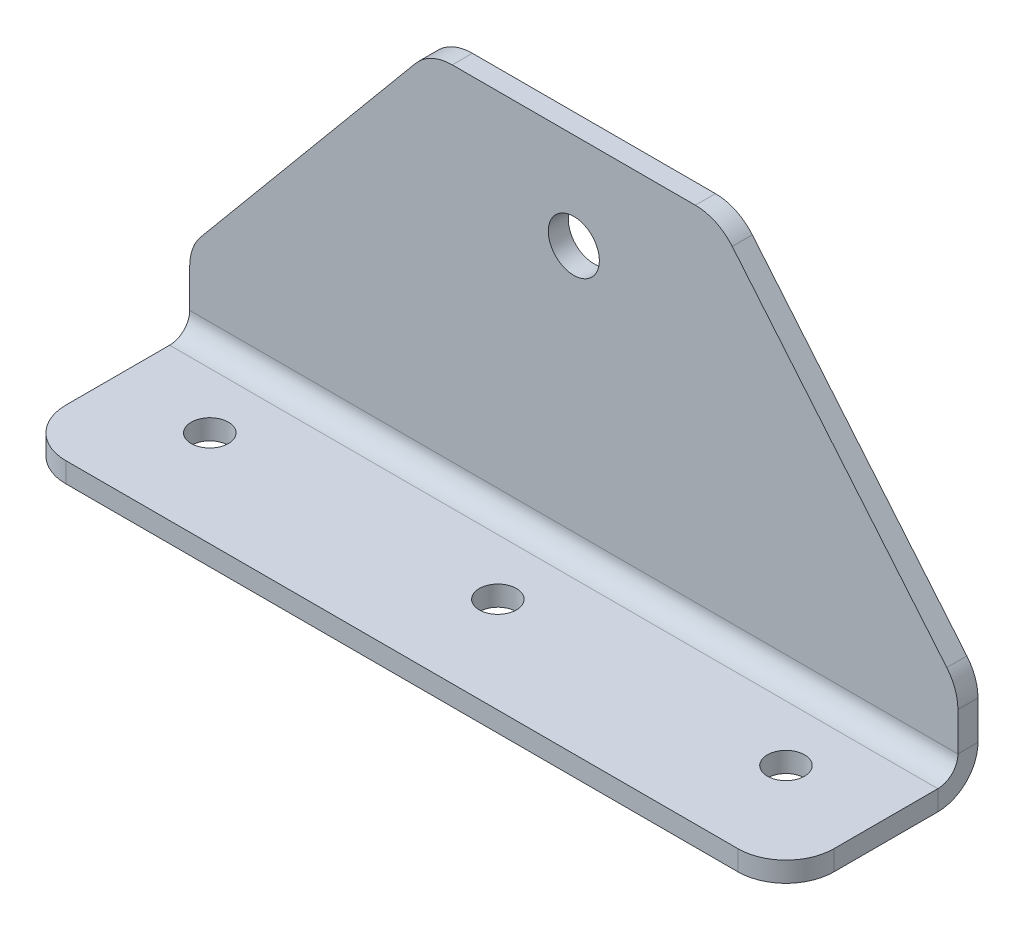
ISO-10303-21;
HEADER;
FILE_DESCRIPTION(('STEP AP214'),'2;1');
FILE_NAME('part.step','',(''),(''),'','','');
FILE_SCHEMA(('AUTOMOTIVE_DESIGN { 1 0 10303 214 1 1 1 1 }'));
ENDSEC;
DATA;
#1=APPLICATION_CONTEXT('core data for automotive mechanical design processes');
#2=APPLICATION_PROTOCOL_DEFINITION('international standard','automotive_design',2000,#1);
#3=PRODUCT_CONTEXT('',#1,'mechanical');
#4=PRODUCT('Part','Part','',(#3));
#5=PRODUCT_RELATED_PRODUCT_CATEGORY('part','',(#4));
#6=PRODUCT_DEFINITION_FORMATION('','',#4);
#7=PRODUCT_DEFINITION_CONTEXT('part definition',#1,'design');
#8=PRODUCT_DEFINITION('design','',#6,#7);
#9=PRODUCT_DEFINITION_SHAPE('','',#8);
#10=(LENGTH_UNIT() NAMED_UNIT(*) SI_UNIT(.MILLI.,.METRE.));
#11=(NAMED_UNIT(*) PLANE_ANGLE_UNIT() SI_UNIT($,.RADIAN.));
#12=(NAMED_UNIT(*) SI_UNIT($,.STERADIAN.) SOLID_ANGLE_UNIT());
#13=UNCERTAINTY_MEASURE_WITH_UNIT(LENGTH_MEASURE(1.E-05),#10,'distance_accuracy_value','');
#14=(GEOMETRIC_REPRESENTATION_CONTEXT(3) GLOBAL_UNCERTAINTY_ASSIGNED_CONTEXT((#13)) GLOBAL_UNIT_ASSIGNED_CONTEXT((#10,
#11,#12)) REPRESENTATION_CONTEXT('',''));
#15=CARTESIAN_POINT('',(0.,0.,0.));
#16=DIRECTION('',(0.,0.,1.));
#17=DIRECTION('',(1.,0.,0.));
#18=AXIS2_PLACEMENT_3D('',#15,#16,#17);
#19=CARTESIAN_POINT('',(101.6,12.7,-2.65684));
#20=DIRECTION('',(1.,0.,0.));
#21=DIRECTION('',(0.,0.,-1.));
#22=AXIS2_PLACEMENT_3D('',#19,#20,#21);
#23=PLANE('',#22);
#24=DIRECTION('',(0.,1.,0.));
#25=VECTOR('',#24,1.);
#26=CARTESIAN_POINT('',(101.6,12.7,-2.65684));
#27=LINE('',#26,#25);
#28=CARTESIAN_POINT('',(101.6,5.31368,-2.65684000000001));
#29=VERTEX_POINT('',#28);
#30=CARTESIAN_POINT('',(101.6,10.4009829115986,-2.65684));
#31=VERTEX_POINT('',#30);
#32=EDGE_CURVE('E263',#29,#31,#27,.T.);
#33=ORIENTED_EDGE('',*,*,#32,.T.);
#34=DIRECTION('',(0.,0.,1.));
#35=VECTOR('',#34,1.);
#36=CARTESIAN_POINT('',(101.6,10.4009829115986,-2.65684));
#37=LINE('',#36,#35);
#38=CARTESIAN_POINT('',(101.6,10.4009829115986,0.));
#39=VERTEX_POINT('',#38);
#40=EDGE_CURVE('E324',#31,#39,#37,.T.);
#41=ORIENTED_EDGE('',*,*,#40,.T.);
#42=DIRECTION('',(0.,1.,0.));
#43=VECTOR('',#42,1.);
#44=CARTESIAN_POINT('',(101.6,12.7,0.));
#45=LINE('',#44,#43);
#46=CARTESIAN_POINT('',(101.6,5.31367999999999,0.));
#47=VERTEX_POINT('',#46);
#48=EDGE_CURVE('E260',#47,#39,#45,.T.);
#49=ORIENTED_EDGE('',*,*,#48,.F.);
#50=DIRECTION('',(0.,0.,-1.));
#51=VECTOR('',#50,1.);
#52=CARTESIAN_POINT('',(101.6,5.31367999999999,0.));
#53=LINE('',#52,#51);
#54=EDGE_CURVE('E245',#47,#29,#53,.T.);
#55=ORIENTED_EDGE('',*,*,#54,.T.);
#56=EDGE_LOOP('',(#33,#41,#49,#55));
#57=FACE_BOUND('',#56,.T.);
#58=ADVANCED_FACE('F66',(#57),#23,.T.);
#59=CARTESIAN_POINT('',(0.,0.,-2.65684));
#60=DIRECTION('',(0.,0.,-1.));
#61=DIRECTION('',(-1.,0.,0.));
#62=AXIS2_PLACEMENT_3D('',#59,#60,#61);
#63=PLANE('',#62);
#64=CARTESIAN_POINT('',(50.8,38.0999999999999,-2.65684000000001));
#65=DIRECTION('',(0.,0.,1.));
#66=DIRECTION('',(1.,0.,0.));
#67=AXIS2_PLACEMENT_3D('',#64,#65,#66);
#68=CIRCLE('',#67,3.3782);
#69=CARTESIAN_POINT('',(54.1782,38.0999999999999,-2.65684000000001));
#70=VERTEX_POINT('',#69);
#71=EDGE_CURVE('E508',#70,#70,#68,.T.);
#72=ORIENTED_EDGE('',*,*,#71,.T.);
#73=EDGE_LOOP('',(#72));
#74=FACE_BOUND('',#73,.T.);
#75=DIRECTION('',(-0.64018439966448,0.768221279597376,0.));
#76=VECTOR('',#75,1.);
#77=CARTESIAN_POINT('',(69.85,50.8,-2.65684));
#78=LINE('',#77,#76);
#79=CARTESIAN_POINT('',(100.128205125443,14.466153849468,-2.65684));
#80=VERTEX_POINT('',#79);
#81=CARTESIAN_POINT('',(71.7540242184421,48.5151709378694,-2.65684));
#82=VERTEX_POINT('',#81);
#83=EDGE_CURVE('E267',#80,#82,#78,.T.);
#84=ORIENTED_EDGE('',*,*,#83,.F.);
#85=CARTESIAN_POINT('',(95.25,10.4009829115986,-2.65684));
#86=DIRECTION('',(0.,0.,-1.));
#87=DIRECTION('',(-1.,0.,0.));
#88=AXIS2_PLACEMENT_3D('',#85,#86,#87);
#89=CIRCLE('',#88,6.35);
#90=EDGE_CURVE('E355',#80,#31,#89,.T.);
#91=ORIENTED_EDGE('',*,*,#90,.T.);
#92=ORIENTED_EDGE('',*,*,#32,.F.);
#93=DIRECTION('',(1.,0.,0.));
#94=VECTOR('',#93,1.);
#95=CARTESIAN_POINT('',(101.6,5.31368,-2.65684000000001));
#96=LINE('',#95,#94);
#97=CARTESIAN_POINT('',(0.,5.31368000000001,-2.65684));
#98=VERTEX_POINT('',#97);
#99=EDGE_CURVE('E206',#29,#98,#96,.F.);
#100=ORIENTED_EDGE('',*,*,#99,.T.);
#101=DIRECTION('',(0.,-1.,0.));
#102=VECTOR('',#101,1.);
#103=CARTESIAN_POINT('',(0.,0.,-2.65684));
#104=LINE('',#103,#102);
#105=CARTESIAN_POINT('',(0.,10.4009829115986,-2.65684));
#106=VERTEX_POINT('',#105);
#107=EDGE_CURVE('E279',#106,#98,#104,.T.);
#108=ORIENTED_EDGE('',*,*,#107,.F.);
#109=CARTESIAN_POINT('',(6.35,10.4009829115986,-2.65684));
#110=DIRECTION('',(0.,0.,-1.));
#111=DIRECTION('',(-1.,0.,0.));
#112=AXIS2_PLACEMENT_3D('',#109,#110,#111);
#113=CIRCLE('',#112,6.35);
#114=CARTESIAN_POINT('',(1.47179487455666,14.466153849468,-2.65684));
#115=VERTEX_POINT('',#114);
#116=EDGE_CURVE('E347',#106,#115,#113,.T.);
#117=ORIENTED_EDGE('',*,*,#116,.T.);
#118=DIRECTION('',(-0.64018439966448,-0.768221279597376,0.));
#119=VECTOR('',#118,1.);
#120=CARTESIAN_POINT('',(0.,12.7,-2.65684));
#121=LINE('',#120,#119);
#122=CARTESIAN_POINT('',(29.8459757815579,48.5151709378694,-2.65684));
#123=VERTEX_POINT('',#122);
#124=EDGE_CURVE('E275',#123,#115,#121,.T.);
#125=ORIENTED_EDGE('',*,*,#124,.F.);
#126=CARTESIAN_POINT('',(34.7241809070012,44.45,-2.65684));
#127=DIRECTION('',(0.,0.,-1.));
#128=DIRECTION('',(-1.,0.,0.));
#129=AXIS2_PLACEMENT_3D('',#126,#127,#128);
#130=CIRCLE('',#129,6.35);
#131=CARTESIAN_POINT('',(34.7241809070012,50.8,-2.65684));
#132=VERTEX_POINT('',#131);
#133=EDGE_CURVE('E84',#123,#132,#130,.T.);
#134=ORIENTED_EDGE('',*,*,#133,.T.);
#135=DIRECTION('',(-1.,0.,0.));
#136=VECTOR('',#135,1.);
#137=CARTESIAN_POINT('',(31.75,50.8,-2.65684));
#138=LINE('',#137,#136);
#139=CARTESIAN_POINT('',(66.8758190929988,50.8,-2.65684));
#140=VERTEX_POINT('',#139);
#141=EDGE_CURVE('E272',#140,#132,#138,.T.);
#142=ORIENTED_EDGE('',*,*,#141,.F.);
#143=CARTESIAN_POINT('',(66.8758190929988,44.45,-2.65684));
#144=DIRECTION('',(0.,0.,-1.));
#145=DIRECTION('',(-1.,0.,0.));
#146=AXIS2_PLACEMENT_3D('',#143,#144,#145);
#147=CIRCLE('',#146,6.35);
#148=EDGE_CURVE('E352',#140,#82,#147,.T.);
#149=ORIENTED_EDGE('',*,*,#148,.T.);
#150=EDGE_LOOP('',(#84,#91,#92,#100,#108,#117,#125,#134,#142,#149));
#151=FACE_BOUND('',#150,.T.);
#152=ADVANCED_FACE('F441',(#74,#151),#63,.T.);
#153=CARTESIAN_POINT('',(0.,0.,0.));
#154=DIRECTION('',(0.,0.,-1.));
#155=DIRECTION('',(-1.,0.,0.));
#156=AXIS2_PLACEMENT_3D('',#153,#154,#155);
#157=PLANE('',#156);
#158=CARTESIAN_POINT('',(50.8,38.0999999999999,0.));
#159=DIRECTION('',(0.,0.,1.));
#160=DIRECTION('',(1.,0.,0.));
#161=AXIS2_PLACEMENT_3D('',#158,#159,#160);
#162=CIRCLE('',#161,3.37819999999996);
#163=CARTESIAN_POINT('',(54.1782,38.0999999999999,0.));
#164=VERTEX_POINT('',#163);
#165=EDGE_CURVE('E511',#164,#164,#162,.T.);
#166=ORIENTED_EDGE('',*,*,#165,.F.);
#167=EDGE_LOOP('',(#166));
#168=FACE_BOUND('',#167,.T.);
#169=ORIENTED_EDGE('',*,*,#48,.T.);
#170=CARTESIAN_POINT('',(95.25,10.4009829115986,0.));
#171=DIRECTION('',(0.,0.,-1.));
#172=DIRECTION('',(-1.,0.,0.));
#173=AXIS2_PLACEMENT_3D('',#170,#171,#172);
#174=CIRCLE('',#173,6.35);
#175=CARTESIAN_POINT('',(100.128205125443,14.466153849468,0.));
#176=VERTEX_POINT('',#175);
#177=EDGE_CURVE('E337',#39,#176,#174,.F.);
#178=ORIENTED_EDGE('',*,*,#177,.T.);
#179=DIRECTION('',(-0.64018439966448,0.768221279597376,0.));
#180=VECTOR('',#179,1.);
#181=CARTESIAN_POINT('',(69.85,50.8,0.));
#182=LINE('',#181,#180);
#183=CARTESIAN_POINT('',(71.7540242184421,48.5151709378694,0.));
#184=VERTEX_POINT('',#183);
#185=EDGE_CURVE('E286',#176,#184,#182,.T.);
#186=ORIENTED_EDGE('',*,*,#185,.T.);
#187=CARTESIAN_POINT('',(66.8758190929988,44.45,0.));
#188=DIRECTION('',(0.,0.,-1.));
#189=DIRECTION('',(-1.,0.,0.));
#190=AXIS2_PLACEMENT_3D('',#187,#188,#189);
#191=CIRCLE('',#190,6.35);
#192=CARTESIAN_POINT('',(66.8758190929988,50.8,0.));
#193=VERTEX_POINT('',#192);
#194=EDGE_CURVE('E334',#184,#193,#191,.F.);
#195=ORIENTED_EDGE('',*,*,#194,.T.);
#196=DIRECTION('',(-1.,0.,0.));
#197=VECTOR('',#196,1.);
#198=CARTESIAN_POINT('',(31.75,50.8,0.));
#199=LINE('',#198,#197);
#200=CARTESIAN_POINT('',(34.7241809070012,50.8,0.));
#201=VERTEX_POINT('',#200);
#202=EDGE_CURVE('E290',#193,#201,#199,.T.);
#203=ORIENTED_EDGE('',*,*,#202,.T.);
#204=CARTESIAN_POINT('',(34.7241809070012,44.45,0.));
#205=DIRECTION('',(0.,0.,-1.));
#206=DIRECTION('',(-1.,0.,0.));
#207=AXIS2_PLACEMENT_3D('',#204,#205,#206);
#208=CIRCLE('',#207,6.35);
#209=CARTESIAN_POINT('',(29.8459757815579,48.5151709378694,0.));
#210=VERTEX_POINT('',#209);
#211=EDGE_CURVE('E331',#201,#210,#208,.F.);
#212=ORIENTED_EDGE('',*,*,#211,.T.);
#213=DIRECTION('',(-0.64018439966448,-0.768221279597376,0.));
#214=VECTOR('',#213,1.);
#215=CARTESIAN_POINT('',(0.,12.7,0.));
#216=LINE('',#215,#214);
#217=CARTESIAN_POINT('',(1.47179487455666,14.466153849468,0.));
#218=VERTEX_POINT('',#217);
#219=EDGE_CURVE('E294',#210,#218,#216,.T.);
#220=ORIENTED_EDGE('',*,*,#219,.T.);
#221=CARTESIAN_POINT('',(6.35,10.4009829115986,0.));
#222=DIRECTION('',(0.,0.,-1.));
#223=DIRECTION('',(-1.,0.,0.));
#224=AXIS2_PLACEMENT_3D('',#221,#222,#223);
#225=CIRCLE('',#224,6.35);
#226=CARTESIAN_POINT('',(0.,10.4009829115986,0.));
#227=VERTEX_POINT('',#226);
#228=EDGE_CURVE('E328',#218,#227,#225,.F.);
#229=ORIENTED_EDGE('',*,*,#228,.T.);
#230=DIRECTION('',(0.,-1.,0.));
#231=VECTOR('',#230,1.);
#232=CARTESIAN_POINT('',(0.,0.,0.));
#233=LINE('',#232,#231);
#234=CARTESIAN_POINT('',(0.,5.31367999999999,0.));
#235=VERTEX_POINT('',#234);
#236=EDGE_CURVE('E268',#227,#235,#233,.T.);
#237=ORIENTED_EDGE('',*,*,#236,.T.);
#238=DIRECTION('',(1.,0.,0.));
#239=VECTOR('',#238,1.);
#240=CARTESIAN_POINT('',(101.6,5.31367999999999,0.));
#241=LINE('',#240,#239);
#242=EDGE_CURVE('E250',#47,#235,#241,.F.);
#243=ORIENTED_EDGE('',*,*,#242,.F.);
#244=EDGE_LOOP('',(#169,#178,#186,#195,#203,#212,#220,#229,#237,#243));
#245=FACE_BOUND('',#244,.T.);
#246=ADVANCED_FACE('F447',(#168,#245),#157,.F.);
#247=CARTESIAN_POINT('',(0.,0.,-2.65684));
#248=DIRECTION('',(-1.,0.,0.));
#249=DIRECTION('',(0.,0.,1.));
#250=AXIS2_PLACEMENT_3D('',#247,#248,#249);
#251=PLANE('',#250);
#252=ORIENTED_EDGE('',*,*,#236,.F.);
#253=DIRECTION('',(0.,0.,1.));
#254=VECTOR('',#253,1.);
#255=CARTESIAN_POINT('',(0.,10.4009829115986,-2.65684));
#256=LINE('',#255,#254);
#257=EDGE_CURVE('E13',#227,#106,#256,.F.);
#258=ORIENTED_EDGE('',*,*,#257,.T.);
#259=ORIENTED_EDGE('',*,*,#107,.T.);
#260=DIRECTION('',(0.,0.,-1.));
#261=VECTOR('',#260,1.);
#262=CARTESIAN_POINT('',(0.,5.31367999999999,0.));
#263=LINE('',#262,#261);
#264=EDGE_CURVE('E256',#235,#98,#263,.T.);
#265=ORIENTED_EDGE('',*,*,#264,.F.);
#266=EDGE_LOOP('',(#252,#258,#259,#265));
#267=FACE_BOUND('',#266,.T.);
#268=ADVANCED_FACE('F461',(#267),#251,.T.);
#269=CARTESIAN_POINT('',(0.,12.7,-2.65684));
#270=DIRECTION('',(-0.768221279597376,0.64018439966448,0.));
#271=DIRECTION('',(-0.64018439966448,-0.768221279597376,0.));
#272=AXIS2_PLACEMENT_3D('',#269,#270,#271);
#273=PLANE('',#272);
#274=ORIENTED_EDGE('',*,*,#219,.F.);
#275=DIRECTION('',(0.,0.,1.));
#276=VECTOR('',#275,1.);
#277=CARTESIAN_POINT('',(29.8459757815579,48.5151709378694,-2.65684));
#278=LINE('',#277,#276);
#279=EDGE_CURVE('E76',#210,#123,#278,.F.);
#280=ORIENTED_EDGE('',*,*,#279,.T.);
#281=ORIENTED_EDGE('',*,*,#124,.T.);
#282=DIRECTION('',(0.,0.,1.));
#283=VECTOR('',#282,1.);
#284=CARTESIAN_POINT('',(1.47179487455666,14.466153849468,-2.65684));
#285=LINE('',#284,#283);
#286=EDGE_CURVE('E364',#115,#218,#285,.T.);
#287=ORIENTED_EDGE('',*,*,#286,.T.);
#288=EDGE_LOOP('',(#274,#280,#281,#287));
#289=FACE_BOUND('',#288,.T.);
#290=ADVANCED_FACE('F458',(#289),#273,.T.);
#291=CARTESIAN_POINT('',(31.75,50.8,-2.65684));
#292=DIRECTION('',(0.,1.,0.));
#293=DIRECTION('',(-1.,0.,0.));
#294=AXIS2_PLACEMENT_3D('',#291,#292,#293);
#295=PLANE('',#294);
#296=ORIENTED_EDGE('',*,*,#202,.F.);
#297=DIRECTION('',(0.,0.,1.));
#298=VECTOR('',#297,1.);
#299=CARTESIAN_POINT('',(66.8758190929988,50.8,-2.65684));
#300=LINE('',#299,#298);
#301=EDGE_CURVE('E91',#193,#140,#300,.F.);
#302=ORIENTED_EDGE('',*,*,#301,.T.);
#303=ORIENTED_EDGE('',*,*,#141,.T.);
#304=DIRECTION('',(0.,0.,1.));
#305=VECTOR('',#304,1.);
#306=CARTESIAN_POINT('',(34.7241809070012,50.8,-2.65684));
#307=LINE('',#306,#305);
#308=EDGE_CURVE('E358',#132,#201,#307,.T.);
#309=ORIENTED_EDGE('',*,*,#308,.T.);
#310=EDGE_LOOP('',(#296,#302,#303,#309));
#311=FACE_BOUND('',#310,.T.);
#312=ADVANCED_FACE('F454',(#311),#295,.T.);
#313=CARTESIAN_POINT('',(69.85,50.8,-2.65684));
#314=DIRECTION('',(0.768221279597375,0.64018439966448,0.));
#315=DIRECTION('',(-0.64018439966448,0.768221279597376,0.));
#316=AXIS2_PLACEMENT_3D('',#313,#314,#315);
#317=PLANE('',#316);
#318=ORIENTED_EDGE('',*,*,#185,.F.);
#319=DIRECTION('',(0.,0.,1.));
#320=VECTOR('',#319,1.);
#321=CARTESIAN_POINT('',(100.128205125443,14.466153849468,-2.65684));
#322=LINE('',#321,#320);
#323=EDGE_CURVE('E344',#176,#80,#322,.F.);
#324=ORIENTED_EDGE('',*,*,#323,.T.);
#325=ORIENTED_EDGE('',*,*,#83,.T.);
#326=DIRECTION('',(0.,0.,1.));
#327=VECTOR('',#326,1.);
#328=CARTESIAN_POINT('',(71.7540242184421,48.5151709378694,-2.65684));
#329=LINE('',#328,#327);
#330=EDGE_CURVE('E340',#82,#184,#329,.T.);
#331=ORIENTED_EDGE('',*,*,#330,.T.);
#332=EDGE_LOOP('',(#318,#324,#325,#331));
#333=FACE_BOUND('',#332,.T.);
#334=ADVANCED_FACE('F451',(#333),#317,.T.);
#335=CARTESIAN_POINT('',(0.,5.31367999999999,2.65684));
#336=DIRECTION('',(-1.,0.,0.));
#337=DIRECTION('',(0.,0.,1.));
#338=AXIS2_PLACEMENT_3D('',#335,#336,#337);
#339=PLANE('',#338);
#340=DIRECTION('',(0.,-1.,0.));
#341=VECTOR('',#340,1.);
#342=CARTESIAN_POINT('',(0.,0.,2.65683999999998));
#343=LINE('',#342,#341);
#344=CARTESIAN_POINT('',(0.,2.65683999999999,2.65683999999999));
#345=VERTEX_POINT('',#344);
#346=CARTESIAN_POINT('',(0.,0.,2.65683999999998));
#347=VERTEX_POINT('',#346);
#348=EDGE_CURVE('E236',#345,#347,#343,.T.);
#349=ORIENTED_EDGE('',*,*,#348,.F.);
#350=CARTESIAN_POINT('',(0.,5.31367999999999,2.65684));
#351=DIRECTION('',(1.,0.,0.));
#352=DIRECTION('',(0.,0.,-1.));
#353=AXIS2_PLACEMENT_3D('',#350,#351,#352);
#354=CIRCLE('',#353,2.65684);
#355=EDGE_CURVE('E210',#235,#345,#354,.F.);
#356=ORIENTED_EDGE('',*,*,#355,.F.);
#357=ORIENTED_EDGE('',*,*,#264,.T.);
#358=CARTESIAN_POINT('',(0.,5.31367999999999,2.65684));
#359=DIRECTION('',(1.,0.,0.));
#360=DIRECTION('',(0.,0.,-1.));
#361=AXIS2_PLACEMENT_3D('',#358,#359,#360);
#362=CIRCLE('',#361,5.31368);
#363=EDGE_CURVE('E243',#98,#347,#362,.F.);
#364=ORIENTED_EDGE('',*,*,#363,.T.);
#365=EDGE_LOOP('',(#349,#356,#357,#364));
#366=FACE_BOUND('',#365,.T.);
#367=ADVANCED_FACE('F421',(#366),#339,.T.);
#368=CARTESIAN_POINT('',(101.6,5.31367999999999,2.65683999999999));
#369=DIRECTION('',(-1.,0.,0.));
#370=DIRECTION('',(0.,0.,1.));
#371=AXIS2_PLACEMENT_3D('',#368,#369,#370);
#372=PLANE('',#371);
#373=CARTESIAN_POINT('',(101.6,5.31367999999999,2.65683999999999));
#374=DIRECTION('',(1.,0.,0.));
#375=DIRECTION('',(0.,0.,-1.));
#376=AXIS2_PLACEMENT_3D('',#373,#374,#375);
#377=CIRCLE('',#376,2.65684);
#378=CARTESIAN_POINT('',(101.6,2.65683999999999,2.65683999999998));
#379=VERTEX_POINT('',#378);
#380=EDGE_CURVE('E195',#379,#47,#377,.T.);
#381=ORIENTED_EDGE('',*,*,#380,.F.);
#382=DIRECTION('',(0.,-1.,0.));
#383=VECTOR('',#382,1.);
#384=CARTESIAN_POINT('',(101.6,2.65683999999999,2.65683999999999));
#385=LINE('',#384,#383);
#386=CARTESIAN_POINT('',(101.6,0.,2.65683999999998));
#387=VERTEX_POINT('',#386);
#388=EDGE_CURVE('E188',#379,#387,#385,.T.);
#389=ORIENTED_EDGE('',*,*,#388,.T.);
#390=CARTESIAN_POINT('',(101.6,5.31367999999999,2.65683999999999));
#391=DIRECTION('',(1.,0.,0.));
#392=DIRECTION('',(0.,0.,-1.));
#393=AXIS2_PLACEMENT_3D('',#390,#391,#392);
#394=CIRCLE('',#393,5.31368);
#395=EDGE_CURVE('E200',#387,#29,#394,.T.);
#396=ORIENTED_EDGE('',*,*,#395,.T.);
#397=ORIENTED_EDGE('',*,*,#54,.F.);
#398=EDGE_LOOP('',(#381,#389,#396,#397));
#399=FACE_BOUND('',#398,.T.);
#400=ADVANCED_FACE('F213',(#399),#372,.F.);
#401=CARTESIAN_POINT('',(101.6,5.31367999999999,2.65683999999999));
#402=DIRECTION('',(1.,0.,0.));
#403=DIRECTION('',(0.,-1.,0.));
#404=AXIS2_PLACEMENT_3D('',#401,#402,#403);
#405=CYLINDRICAL_SURFACE('',#404,5.31368);
#406=ORIENTED_EDGE('',*,*,#99,.F.);
#407=ORIENTED_EDGE('',*,*,#395,.F.);
#408=DIRECTION('',(1.,0.,0.));
#409=VECTOR('',#408,1.);
#410=CARTESIAN_POINT('',(0.,0.,2.65683999999998));
#411=LINE('',#410,#409);
#412=EDGE_CURVE('E203',#347,#387,#411,.T.);
#413=ORIENTED_EDGE('',*,*,#412,.F.);
#414=ORIENTED_EDGE('',*,*,#363,.F.);
#415=EDGE_LOOP('',(#406,#407,#413,#414));
#416=FACE_BOUND('',#415,.T.);
#417=ADVANCED_FACE('F201',(#416),#405,.T.);
#418=CARTESIAN_POINT('',(101.6,5.31367999999999,2.65683999999999));
#419=DIRECTION('',(1.,0.,0.));
#420=DIRECTION('',(0.,-1.,0.));
#421=AXIS2_PLACEMENT_3D('',#418,#419,#420);
#422=CYLINDRICAL_SURFACE('',#421,2.65684);
#423=ORIENTED_EDGE('',*,*,#242,.T.);
#424=ORIENTED_EDGE('',*,*,#355,.T.);
#425=DIRECTION('',(-1.,0.,0.));
#426=VECTOR('',#425,1.);
#427=CARTESIAN_POINT('',(0.,2.65683999999999,2.65683999999999));
#428=LINE('',#427,#426);
#429=EDGE_CURVE('E216',#345,#379,#428,.F.);
#430=ORIENTED_EDGE('',*,*,#429,.T.);
#431=ORIENTED_EDGE('',*,*,#380,.T.);
#432=EDGE_LOOP('',(#423,#424,#430,#431));
#433=FACE_BOUND('',#432,.T.);
#434=ADVANCED_FACE('F425',(#433),#422,.F.);
#435=CARTESIAN_POINT('',(101.6,0.,0.));
#436=DIRECTION('',(1.,0.,0.));
#437=DIRECTION('',(0.,1.,0.));
#438=AXIS2_PLACEMENT_3D('',#435,#436,#437);
#439=PLANE('',#438);
#440=DIRECTION('',(0.,0.,1.));
#441=VECTOR('',#440,1.);
#442=CARTESIAN_POINT('',(101.6,2.65684,0.));
#443=LINE('',#442,#441);
#444=CARTESIAN_POINT('',(101.6,2.65683999999995,16.39316));
#445=VERTEX_POINT('',#444);
#446=EDGE_CURVE('E400',#445,#379,#443,.F.);
#447=ORIENTED_EDGE('',*,*,#446,.F.);
#448=DIRECTION('',(0.,1.,0.));
#449=VECTOR('',#448,1.);
#450=CARTESIAN_POINT('',(101.6,0.,16.39316));
#451=LINE('',#450,#449);
#452=CARTESIAN_POINT('',(101.6,0.,16.39316));
#453=VERTEX_POINT('',#452);
#454=EDGE_CURVE('E190',#445,#453,#451,.F.);
#455=ORIENTED_EDGE('',*,*,#454,.T.);
#456=DIRECTION('',(0.,0.,-1.));
#457=VECTOR('',#456,1.);
#458=CARTESIAN_POINT('',(101.6,0.,0.));
#459=LINE('',#458,#457);
#460=EDGE_CURVE('E183',#453,#387,#459,.T.);
#461=ORIENTED_EDGE('',*,*,#460,.T.);
#462=ORIENTED_EDGE('',*,*,#388,.F.);
#463=EDGE_LOOP('',(#447,#455,#461,#462));
#464=FACE_BOUND('',#463,.T.);
#465=ADVANCED_FACE('F186',(#464),#439,.T.);
#466=CARTESIAN_POINT('',(0.,0.,22.74316));
#467=DIRECTION('',(-1.,0.,0.));
#468=DIRECTION('',(0.,0.,1.));
#469=AXIS2_PLACEMENT_3D('',#466,#467,#468);
#470=PLANE('',#469);
#471=DIRECTION('',(0.,0.,1.));
#472=VECTOR('',#471,1.);
#473=CARTESIAN_POINT('',(0.,0.,22.74316));
#474=LINE('',#473,#472);
#475=CARTESIAN_POINT('',(0.,0.,16.39316));
#476=VERTEX_POINT('',#475);
#477=EDGE_CURVE('E222',#347,#476,#474,.T.);
#478=ORIENTED_EDGE('',*,*,#477,.T.);
#479=DIRECTION('',(0.,1.,0.));
#480=VECTOR('',#479,1.);
#481=CARTESIAN_POINT('',(0.,0.,16.39316));
#482=LINE('',#481,#480);
#483=CARTESIAN_POINT('',(0.,2.65683999999994,16.39316));
#484=VERTEX_POINT('',#483);
#485=EDGE_CURVE('E282',#476,#484,#482,.T.);
#486=ORIENTED_EDGE('',*,*,#485,.T.);
#487=DIRECTION('',(0.,0.,-1.));
#488=VECTOR('',#487,1.);
#489=CARTESIAN_POINT('',(0.,2.65684,0.));
#490=LINE('',#489,#488);
#491=EDGE_CURVE('E224',#345,#484,#490,.F.);
#492=ORIENTED_EDGE('',*,*,#491,.F.);
#493=ORIENTED_EDGE('',*,*,#348,.T.);
#494=EDGE_LOOP('',(#478,#486,#492,#493));
#495=FACE_BOUND('',#494,.T.);
#496=ADVANCED_FACE('F417',(#495),#470,.T.);
#497=CARTESIAN_POINT('',(0.,0.,0.));
#498=DIRECTION('',(0.,-1.,0.));
#499=DIRECTION('',(0.,0.,-1.));
#500=AXIS2_PLACEMENT_3D('',#497,#498,#499);
#501=PLANE('',#500);
#502=CARTESIAN_POINT('',(88.9,0.,10.04316));
#503=DIRECTION('',(0.,-1.,0.));
#504=DIRECTION('',(0.,0.,-1.));
#505=AXIS2_PLACEMENT_3D('',#502,#503,#504);
#506=CIRCLE('',#505,2.45745);
#507=CARTESIAN_POINT('',(88.9,0.,7.58570999999997));
#508=VERTEX_POINT('',#507);
#509=EDGE_CURVE('E391',#508,#508,#506,.T.);
#510=ORIENTED_EDGE('',*,*,#509,.F.);
#511=EDGE_LOOP('',(#510));
#512=FACE_BOUND('',#511,.T.);
#513=CARTESIAN_POINT('',(50.8,0.,10.04316));
#514=DIRECTION('',(0.,-1.,0.));
#515=DIRECTION('',(0.,0.,-1.));
#516=AXIS2_PLACEMENT_3D('',#513,#514,#515);
#517=CIRCLE('',#516,2.45744999999999);
#518=CARTESIAN_POINT('',(50.8,0.,7.58570999999998));
#519=VERTEX_POINT('',#518);
#520=EDGE_CURVE('E376',#519,#519,#517,.T.);
#521=ORIENTED_EDGE('',*,*,#520,.F.);
#522=EDGE_LOOP('',(#521));
#523=FACE_BOUND('',#522,.T.);
#524=CARTESIAN_POINT('',(12.7,0.,10.04316));
#525=DIRECTION('',(0.,-1.,0.));
#526=DIRECTION('',(0.,0.,-1.));
#527=AXIS2_PLACEMENT_3D('',#524,#525,#526);
#528=CIRCLE('',#527,2.45744999999999);
#529=CARTESIAN_POINT('',(12.7,0.,7.58570999999998));
#530=VERTEX_POINT('',#529);
#531=EDGE_CURVE('E372',#530,#530,#528,.T.);
#532=ORIENTED_EDGE('',*,*,#531,.F.);
#533=EDGE_LOOP('',(#532));
#534=FACE_BOUND('',#533,.T.);
#535=DIRECTION('',(1.,0.,0.));
#536=VECTOR('',#535,1.);
#537=CARTESIAN_POINT('',(101.6,0.,22.74316));
#538=LINE('',#537,#536);
#539=CARTESIAN_POINT('',(6.34999999999998,0.,22.74316));
#540=VERTEX_POINT('',#539);
#541=CARTESIAN_POINT('',(95.25,0.,22.74316));
#542=VERTEX_POINT('',#541);
#543=EDGE_CURVE('E196',#540,#542,#538,.T.);
#544=ORIENTED_EDGE('',*,*,#543,.F.);
#545=CARTESIAN_POINT('',(6.34999999999998,0.,16.39316));
#546=DIRECTION('',(0.,-1.,0.));
#547=DIRECTION('',(0.,0.,-1.));
#548=AXIS2_PLACEMENT_3D('',#545,#546,#547);
#549=CIRCLE('',#548,6.35);
#550=EDGE_CURVE('E319',#540,#476,#549,.T.);
#551=ORIENTED_EDGE('',*,*,#550,.T.);
#552=ORIENTED_EDGE('',*,*,#477,.F.);
#553=ORIENTED_EDGE('',*,*,#412,.T.);
#554=ORIENTED_EDGE('',*,*,#460,.F.);
#555=CARTESIAN_POINT('',(95.25,0.,16.39316));
#556=DIRECTION('',(0.,-1.,0.));
#557=DIRECTION('',(0.,0.,-1.));
#558=AXIS2_PLACEMENT_3D('',#555,#556,#557);
#559=CIRCLE('',#558,6.35);
#560=EDGE_CURVE('E316',#453,#542,#559,.T.);
#561=ORIENTED_EDGE('',*,*,#560,.T.);
#562=EDGE_LOOP('',(#544,#551,#552,#553,#554,#561));
#563=FACE_BOUND('',#562,.T.);
#564=ADVANCED_FACE('F220',(#512,#523,#534,#563),#501,.T.);
#565=CARTESIAN_POINT('',(0.,2.65684,0.));
#566=DIRECTION('',(0.,-1.,0.));
#567=DIRECTION('',(0.,0.,-1.));
#568=AXIS2_PLACEMENT_3D('',#565,#566,#567);
#569=PLANE('',#568);
#570=CARTESIAN_POINT('',(88.9,2.65683999999997,10.04316));
#571=DIRECTION('',(0.,-1.,0.));
#572=DIRECTION('',(0.,0.,-1.));
#573=AXIS2_PLACEMENT_3D('',#570,#571,#572);
#574=CIRCLE('',#573,2.45744999999999);
#575=CARTESIAN_POINT('',(88.9,2.65683999999998,7.58570999999998));
#576=VERTEX_POINT('',#575);
#577=EDGE_CURVE('E70',#576,#576,#574,.T.);
#578=ORIENTED_EDGE('',*,*,#577,.T.);
#579=EDGE_LOOP('',(#578));
#580=FACE_BOUND('',#579,.T.);
#581=CARTESIAN_POINT('',(50.8,2.65683999999997,10.04316));
#582=DIRECTION('',(0.,-1.,0.));
#583=DIRECTION('',(0.,0.,-1.));
#584=AXIS2_PLACEMENT_3D('',#581,#582,#583);
#585=CIRCLE('',#584,2.45744999999999);
#586=CARTESIAN_POINT('',(50.8,2.65683999999997,7.58570999999998));
#587=VERTEX_POINT('',#586);
#588=EDGE_CURVE('E373',#587,#587,#585,.T.);
#589=ORIENTED_EDGE('',*,*,#588,.T.);
#590=EDGE_LOOP('',(#589));
#591=FACE_BOUND('',#590,.T.);
#592=CARTESIAN_POINT('',(12.7,2.65683999999997,10.04316));
#593=DIRECTION('',(0.,-1.,0.));
#594=DIRECTION('',(0.,0.,-1.));
#595=AXIS2_PLACEMENT_3D('',#592,#593,#594);
#596=CIRCLE('',#595,2.45744999999999);
#597=CARTESIAN_POINT('',(12.7,2.65683999999997,7.58570999999998));
#598=VERTEX_POINT('',#597);
#599=EDGE_CURVE('E240',#598,#598,#596,.T.);
#600=ORIENTED_EDGE('',*,*,#599,.T.);
#601=EDGE_LOOP('',(#600));
#602=FACE_BOUND('',#601,.T.);
#603=ORIENTED_EDGE('',*,*,#491,.T.);
#604=CARTESIAN_POINT('',(6.34999999999998,2.65683999999994,16.39316));
#605=DIRECTION('',(0.,-1.,0.));
#606=DIRECTION('',(0.,0.,-1.));
#607=AXIS2_PLACEMENT_3D('',#604,#605,#606);
#608=CIRCLE('',#607,6.35);
#609=CARTESIAN_POINT('',(6.34999999999998,2.65683999999992,22.74316));
#610=VERTEX_POINT('',#609);
#611=EDGE_CURVE('E306',#484,#610,#608,.F.);
#612=ORIENTED_EDGE('',*,*,#611,.T.);
#613=DIRECTION('',(-1.,0.,0.));
#614=VECTOR('',#613,1.);
#615=CARTESIAN_POINT('',(0.,2.65683999999992,22.74316));
#616=LINE('',#615,#614);
#617=CARTESIAN_POINT('',(95.25,2.65683999999992,22.74316));
#618=VERTEX_POINT('',#617);
#619=EDGE_CURVE('E229',#610,#618,#616,.F.);
#620=ORIENTED_EDGE('',*,*,#619,.T.);
#621=CARTESIAN_POINT('',(95.25,2.65683999999995,16.39316));
#622=DIRECTION('',(0.,-1.,0.));
#623=DIRECTION('',(0.,0.,-1.));
#624=AXIS2_PLACEMENT_3D('',#621,#622,#623);
#625=CIRCLE('',#624,6.35);
#626=EDGE_CURVE('E303',#618,#445,#625,.F.);
#627=ORIENTED_EDGE('',*,*,#626,.T.);
#628=ORIENTED_EDGE('',*,*,#446,.T.);
#629=ORIENTED_EDGE('',*,*,#429,.F.);
#630=EDGE_LOOP('',(#603,#612,#620,#627,#628,#629));
#631=FACE_BOUND('',#630,.T.);
#632=ADVANCED_FACE('F407',(#580,#591,#602,#631),#569,.F.);
#633=CARTESIAN_POINT('',(101.6,0.,22.74316));
#634=DIRECTION('',(0.,0.,1.));
#635=DIRECTION('',(0.,-1.,0.));
#636=AXIS2_PLACEMENT_3D('',#633,#634,#635);
#637=PLANE('',#636);
#638=ORIENTED_EDGE('',*,*,#619,.F.);
#639=DIRECTION('',(0.,1.,0.));
#640=VECTOR('',#639,1.);
#641=CARTESIAN_POINT('',(6.34999999999998,0.,22.74316));
#642=LINE('',#641,#640);
#643=EDGE_CURVE('E313',#610,#540,#642,.F.);
#644=ORIENTED_EDGE('',*,*,#643,.T.);
#645=ORIENTED_EDGE('',*,*,#543,.T.);
#646=DIRECTION('',(0.,1.,0.));
#647=VECTOR('',#646,1.);
#648=CARTESIAN_POINT('',(95.25,0.,22.74316));
#649=LINE('',#648,#647);
#650=EDGE_CURVE('E309',#542,#618,#649,.T.);
#651=ORIENTED_EDGE('',*,*,#650,.T.);
#652=EDGE_LOOP('',(#638,#644,#645,#651));
#653=FACE_BOUND('',#652,.T.);
#654=ADVANCED_FACE('F410',(#653),#637,.T.);
#655=CARTESIAN_POINT('',(6.34999999999998,0.,16.39316));
#656=DIRECTION('',(0.,1.,0.));
#657=DIRECTION('',(0.,0.,1.));
#658=AXIS2_PLACEMENT_3D('',#655,#656,#657);
#659=CYLINDRICAL_SURFACE('',#658,6.35);
#660=ORIENTED_EDGE('',*,*,#550,.F.);
#661=ORIENTED_EDGE('',*,*,#643,.F.);
#662=ORIENTED_EDGE('',*,*,#611,.F.);
#663=ORIENTED_EDGE('',*,*,#485,.F.);
#664=EDGE_LOOP('',(#660,#661,#662,#663));
#665=FACE_BOUND('',#664,.T.);
#666=ADVANCED_FACE('F414',(#665),#659,.T.);
#667=CARTESIAN_POINT('',(95.25,0.,16.39316));
#668=DIRECTION('',(0.,1.,0.));
#669=DIRECTION('',(0.,0.,1.));
#670=AXIS2_PLACEMENT_3D('',#667,#668,#669);
#671=CYLINDRICAL_SURFACE('',#670,6.35);
#672=ORIENTED_EDGE('',*,*,#560,.F.);
#673=ORIENTED_EDGE('',*,*,#454,.F.);
#674=ORIENTED_EDGE('',*,*,#626,.F.);
#675=ORIENTED_EDGE('',*,*,#650,.F.);
#676=EDGE_LOOP('',(#672,#673,#674,#675));
#677=FACE_BOUND('',#676,.T.);
#678=ADVANCED_FACE('F428',(#677),#671,.T.);
#679=CARTESIAN_POINT('',(95.25,10.4009829115986,-2.65684));
#680=DIRECTION('',(0.,0.,1.));
#681=DIRECTION('',(1.,0.,0.));
#682=AXIS2_PLACEMENT_3D('',#679,#680,#681);
#683=CYLINDRICAL_SURFACE('',#682,6.35);
#684=ORIENTED_EDGE('',*,*,#90,.F.);
#685=ORIENTED_EDGE('',*,*,#323,.F.);
#686=ORIENTED_EDGE('',*,*,#177,.F.);
#687=ORIENTED_EDGE('',*,*,#40,.F.);
#688=EDGE_LOOP('',(#684,#685,#686,#687));
#689=FACE_BOUND('',#688,.T.);
#690=ADVANCED_FACE('F430',(#689),#683,.T.);
#691=CARTESIAN_POINT('',(66.8758190929988,44.45,-2.65684));
#692=DIRECTION('',(0.,0.,1.));
#693=DIRECTION('',(1.,0.,0.));
#694=AXIS2_PLACEMENT_3D('',#691,#692,#693);
#695=CYLINDRICAL_SURFACE('',#694,6.35);
#696=ORIENTED_EDGE('',*,*,#148,.F.);
#697=ORIENTED_EDGE('',*,*,#301,.F.);
#698=ORIENTED_EDGE('',*,*,#194,.F.);
#699=ORIENTED_EDGE('',*,*,#330,.F.);
#700=EDGE_LOOP('',(#696,#697,#698,#699));
#701=FACE_BOUND('',#700,.T.);
#702=ADVANCED_FACE('F436',(#701),#695,.T.);
#703=CARTESIAN_POINT('',(34.7241809070012,44.45,-2.65684));
#704=DIRECTION('',(0.,0.,1.));
#705=DIRECTION('',(1.,0.,0.));
#706=AXIS2_PLACEMENT_3D('',#703,#704,#705);
#707=CYLINDRICAL_SURFACE('',#706,6.35);
#708=ORIENTED_EDGE('',*,*,#133,.F.);
#709=ORIENTED_EDGE('',*,*,#279,.F.);
#710=ORIENTED_EDGE('',*,*,#211,.F.);
#711=ORIENTED_EDGE('',*,*,#308,.F.);
#712=EDGE_LOOP('',(#708,#709,#710,#711));
#713=FACE_BOUND('',#712,.T.);
#714=ADVANCED_FACE('F549',(#713),#707,.T.);
#715=CARTESIAN_POINT('',(6.35,10.4009829115986,-2.65684));
#716=DIRECTION('',(0.,0.,1.));
#717=DIRECTION('',(1.,0.,0.));
#718=AXIS2_PLACEMENT_3D('',#715,#716,#717);
#719=CYLINDRICAL_SURFACE('',#718,6.35);
#720=ORIENTED_EDGE('',*,*,#116,.F.);
#721=ORIENTED_EDGE('',*,*,#257,.F.);
#722=ORIENTED_EDGE('',*,*,#228,.F.);
#723=ORIENTED_EDGE('',*,*,#286,.F.);
#724=EDGE_LOOP('',(#720,#721,#722,#723));
#725=FACE_BOUND('',#724,.T.);
#726=ADVANCED_FACE('F68',(#725),#719,.T.);
#727=CARTESIAN_POINT('',(12.7,0.,10.04316));
#728=DIRECTION('',(0.,-1.,0.));
#729=DIRECTION('',(0.,0.,-1.));
#730=AXIS2_PLACEMENT_3D('',#727,#728,#729);
#731=CYLINDRICAL_SURFACE('',#730,2.45744999999999);
#732=ORIENTED_EDGE('',*,*,#531,.T.);
#733=EDGE_LOOP('',(#732));
#734=FACE_BOUND('',#733,.T.);
#735=ORIENTED_EDGE('',*,*,#599,.F.);
#736=EDGE_LOOP('',(#735));
#737=FACE_BOUND('',#736,.T.);
#738=ADVANCED_FACE('F489',(#734,#737),#731,.F.);
#739=CARTESIAN_POINT('',(50.8,0.,10.04316));
#740=DIRECTION('',(0.,-1.,0.));
#741=DIRECTION('',(0.,0.,-1.));
#742=AXIS2_PLACEMENT_3D('',#739,#740,#741);
#743=CYLINDRICAL_SURFACE('',#742,2.45744999999999);
#744=ORIENTED_EDGE('',*,*,#520,.T.);
#745=EDGE_LOOP('',(#744));
#746=FACE_BOUND('',#745,.T.);
#747=ORIENTED_EDGE('',*,*,#588,.F.);
#748=EDGE_LOOP('',(#747));
#749=FACE_BOUND('',#748,.T.);
#750=ADVANCED_FACE('F492',(#746,#749),#743,.F.);
#751=CARTESIAN_POINT('',(88.9,0.,10.04316));
#752=DIRECTION('',(0.,-1.,0.));
#753=DIRECTION('',(0.,0.,-1.));
#754=AXIS2_PLACEMENT_3D('',#751,#752,#753);
#755=CYLINDRICAL_SURFACE('',#754,2.45744999999999);
#756=ORIENTED_EDGE('',*,*,#509,.T.);
#757=EDGE_LOOP('',(#756));
#758=FACE_BOUND('',#757,.T.);
#759=ORIENTED_EDGE('',*,*,#577,.F.);
#760=EDGE_LOOP('',(#759));
#761=FACE_BOUND('',#760,.T.);
#762=ADVANCED_FACE('F496',(#758,#761),#755,.F.);
#763=CARTESIAN_POINT('',(50.8,38.0999999999999,0.));
#764=DIRECTION('',(0.,0.,1.));
#765=DIRECTION('',(1.,0.,0.));
#766=AXIS2_PLACEMENT_3D('',#763,#764,#765);
#767=CYLINDRICAL_SURFACE('',#766,3.37819999999998);
#768=ORIENTED_EDGE('',*,*,#71,.F.);
#769=EDGE_LOOP('',(#768));
#770=FACE_BOUND('',#769,.T.);
#771=ORIENTED_EDGE('',*,*,#165,.T.);
#772=EDGE_LOOP('',(#771));
#773=FACE_BOUND('',#772,.T.);
#774=ADVANCED_FACE('F499',(#770,#773),#767,.F.);
#775=CLOSED_SHELL('',(#58,#152,#246,#268,#290,#312,#334,#367,#400,#417,#434,#465,#496,#564,#632,
#654,#666,#678,#690,#702,#714,#726,#738,#750,#762,#774));
#776=MANIFOLD_SOLID_BREP('B2',#775);
#777=ADVANCED_BREP_SHAPE_REPRESENTATION('',(#18,#776),#14);
#778=SHAPE_DEFINITION_REPRESENTATION(#9,#777);
ENDSEC;
END-ISO-10303-21;
